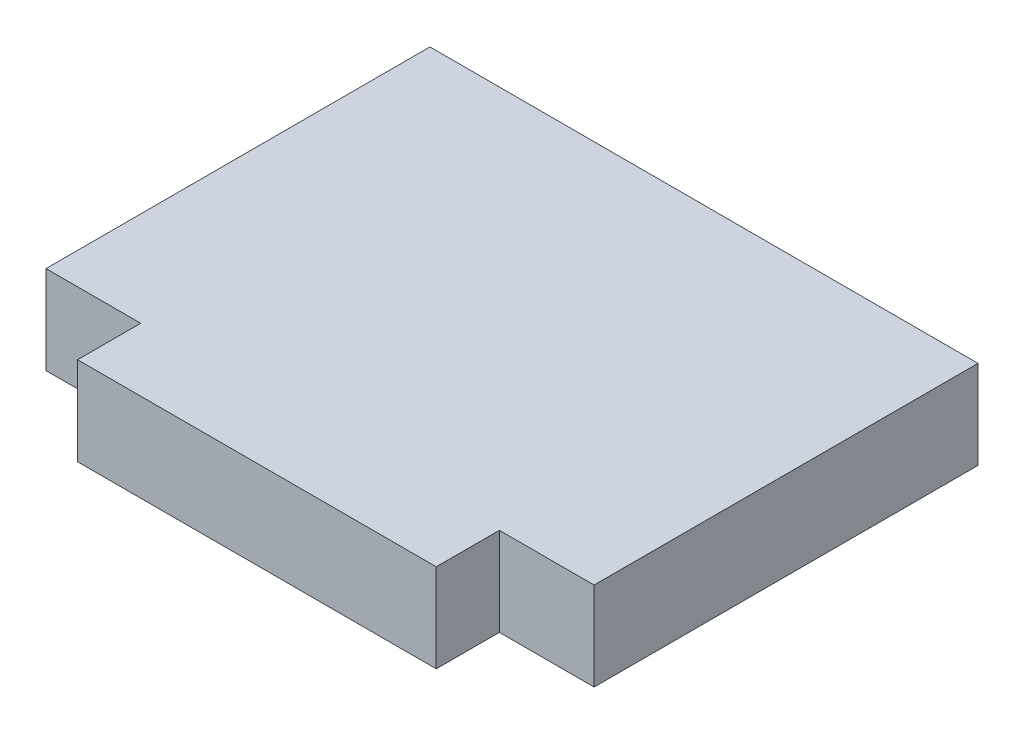
ISO-10303-21;
HEADER;
FILE_DESCRIPTION(('STEP AP214'),'2;1');
FILE_NAME('part.step','',(''),(''),'','','');
FILE_SCHEMA(('AUTOMOTIVE_DESIGN { 1 0 10303 214 1 1 1 1 }'));
ENDSEC;
DATA;
#1=APPLICATION_CONTEXT('core data for automotive mechanical design processes');
#2=APPLICATION_PROTOCOL_DEFINITION('international standard','automotive_design',2000,#1);
#3=PRODUCT_CONTEXT('',#1,'mechanical');
#4=PRODUCT('Part','Part','',(#3));
#5=PRODUCT_RELATED_PRODUCT_CATEGORY('part','',(#4));
#6=PRODUCT_DEFINITION_FORMATION('','',#4);
#7=PRODUCT_DEFINITION_CONTEXT('part definition',#1,'design');
#8=PRODUCT_DEFINITION('design','',#6,#7);
#9=PRODUCT_DEFINITION_SHAPE('','',#8);
#10=(LENGTH_UNIT() NAMED_UNIT(*) SI_UNIT(.MILLI.,.METRE.));
#11=(NAMED_UNIT(*) PLANE_ANGLE_UNIT() SI_UNIT($,.RADIAN.));
#12=(NAMED_UNIT(*) SI_UNIT($,.STERADIAN.) SOLID_ANGLE_UNIT());
#13=UNCERTAINTY_MEASURE_WITH_UNIT(LENGTH_MEASURE(1.E-05),#10,'distance_accuracy_value','');
#14=(GEOMETRIC_REPRESENTATION_CONTEXT(3) GLOBAL_UNCERTAINTY_ASSIGNED_CONTEXT((#13)) GLOBAL_UNIT_ASSIGNED_CONTEXT((#10,
#11,#12)) REPRESENTATION_CONTEXT('',''));
#15=CARTESIAN_POINT('',(0.,0.,0.));
#16=DIRECTION('',(0.,0.,1.));
#17=DIRECTION('',(1.,0.,0.));
#18=AXIS2_PLACEMENT_3D('',#15,#16,#17);
#19=CARTESIAN_POINT('',(55.118,17.78,-25.2860927835052));
#20=DIRECTION('',(-1.,0.,0.));
#21=DIRECTION('',(0.,0.,1.));
#22=AXIS2_PLACEMENT_3D('',#19,#20,#21);
#23=PLANE('',#22);
#24=DIRECTION('',(0.,0.,-1.));
#25=VECTOR('',#24,1.);
#26=CARTESIAN_POINT('',(55.118,17.78,-25.2860927835052));
#27=LINE('',#26,#25);
#28=CARTESIAN_POINT('',(55.118,17.78,51.9299072164948));
#29=VERTEX_POINT('',#28);
#30=CARTESIAN_POINT('',(55.118,17.78,-25.2860927835052));
#31=VERTEX_POINT('',#30);
#32=EDGE_CURVE('E127',#29,#31,#27,.T.);
#33=ORIENTED_EDGE('',*,*,#32,.F.);
#34=DIRECTION('',(0.,1.,0.));
#35=VECTOR('',#34,1.);
#36=CARTESIAN_POINT('',(55.118,0.,51.9299072164948));
#37=LINE('',#36,#35);
#38=CARTESIAN_POINT('',(55.118,0.,51.9299072164948));
#39=VERTEX_POINT('',#38);
#40=EDGE_CURVE('E174',#39,#29,#37,.T.);
#41=ORIENTED_EDGE('',*,*,#40,.F.);
#42=DIRECTION('',(0.,0.,-1.));
#43=VECTOR('',#42,1.);
#44=CARTESIAN_POINT('',(55.118,0.,-25.2860927835052));
#45=LINE('',#44,#43);
#46=CARTESIAN_POINT('',(55.118,0.,-25.2860927835052));
#47=VERTEX_POINT('',#46);
#48=EDGE_CURVE('E154',#39,#47,#45,.T.);
#49=ORIENTED_EDGE('',*,*,#48,.T.);
#50=DIRECTION('',(0.,-1.,0.));
#51=VECTOR('',#50,1.);
#52=CARTESIAN_POINT('',(55.118,17.78,-25.2860927835052));
#53=LINE('',#52,#51);
#54=EDGE_CURVE('E11',#31,#47,#53,.T.);
#55=ORIENTED_EDGE('',*,*,#54,.F.);
#56=EDGE_LOOP('',(#33,#41,#49,#55));
#57=FACE_BOUND('',#56,.T.);
#58=ADVANCED_FACE('F38',(#57),#23,.F.);
#59=CARTESIAN_POINT('',(-55.118,17.78,-25.2860927835052));
#60=DIRECTION('',(0.,0.,1.));
#61=DIRECTION('',(1.,0.,0.));
#62=AXIS2_PLACEMENT_3D('',#59,#60,#61);
#63=PLANE('',#62);
#64=DIRECTION('',(-1.,0.,0.));
#65=VECTOR('',#64,1.);
#66=CARTESIAN_POINT('',(-55.118,0.,-25.2860927835052));
#67=LINE('',#66,#65);
#68=CARTESIAN_POINT('',(-55.118,0.,-25.2860927835052));
#69=VERTEX_POINT('',#68);
#70=EDGE_CURVE('E135',#47,#69,#67,.T.);
#71=ORIENTED_EDGE('',*,*,#70,.T.);
#72=DIRECTION('',(0.,-1.,0.));
#73=VECTOR('',#72,1.);
#74=CARTESIAN_POINT('',(-55.118,17.78,-25.2860927835052));
#75=LINE('',#74,#73);
#76=CARTESIAN_POINT('',(-55.118,17.78,-25.2860927835052));
#77=VERTEX_POINT('',#76);
#78=EDGE_CURVE('E46',#77,#69,#75,.T.);
#79=ORIENTED_EDGE('',*,*,#78,.F.);
#80=DIRECTION('',(-1.,0.,0.));
#81=VECTOR('',#80,1.);
#82=CARTESIAN_POINT('',(-55.118,17.78,-25.2860927835052));
#83=LINE('',#82,#81);
#84=EDGE_CURVE('E132',#31,#77,#83,.T.);
#85=ORIENTED_EDGE('',*,*,#84,.F.);
#86=ORIENTED_EDGE('',*,*,#54,.T.);
#87=EDGE_LOOP('',(#71,#79,#85,#86));
#88=FACE_BOUND('',#87,.T.);
#89=ADVANCED_FACE('F160',(#88),#63,.F.);
#90=CARTESIAN_POINT('',(-55.118,17.78,-25.2860927835052));
#91=DIRECTION('',(1.,0.,0.));
#92=DIRECTION('',(0.,0.,-1.));
#93=AXIS2_PLACEMENT_3D('',#90,#91,#92);
#94=PLANE('',#93);
#95=DIRECTION('',(0.,0.,1.));
#96=VECTOR('',#95,1.);
#97=CARTESIAN_POINT('',(-55.118,0.,-25.2860927835052));
#98=LINE('',#97,#96);
#99=CARTESIAN_POINT('',(-55.118,0.,51.9299072164948));
#100=VERTEX_POINT('',#99);
#101=EDGE_CURVE('E128',#69,#100,#98,.T.);
#102=ORIENTED_EDGE('',*,*,#101,.T.);
#103=DIRECTION('',(0.,1.,0.));
#104=VECTOR('',#103,1.);
#105=CARTESIAN_POINT('',(-55.118,0.,51.9299072164948));
#106=LINE('',#105,#104);
#107=CARTESIAN_POINT('',(-55.118,17.78,51.9299072164948));
#108=VERTEX_POINT('',#107);
#109=EDGE_CURVE('E156',#100,#108,#106,.T.);
#110=ORIENTED_EDGE('',*,*,#109,.T.);
#111=DIRECTION('',(0.,0.,1.));
#112=VECTOR('',#111,1.);
#113=CARTESIAN_POINT('',(-55.118,17.78,-25.2860927835052));
#114=LINE('',#113,#112);
#115=EDGE_CURVE('E145',#77,#108,#114,.T.);
#116=ORIENTED_EDGE('',*,*,#115,.F.);
#117=ORIENTED_EDGE('',*,*,#78,.T.);
#118=EDGE_LOOP('',(#102,#110,#116,#117));
#119=FACE_BOUND('',#118,.T.);
#120=ADVANCED_FACE('F165',(#119),#94,.F.);
#121=CARTESIAN_POINT('',(-55.118,17.78,64.6299072164948));
#122=DIRECTION('',(0.,0.,-1.));
#123=DIRECTION('',(-1.,0.,0.));
#124=AXIS2_PLACEMENT_3D('',#121,#122,#123);
#125=PLANE('',#124);
#126=DIRECTION('',(1.,0.,0.));
#127=VECTOR('',#126,1.);
#128=CARTESIAN_POINT('',(-55.118,17.78,64.6299072164948));
#129=LINE('',#128,#127);
#130=CARTESIAN_POINT('',(-36.068,17.78,64.6299072164948));
#131=VERTEX_POINT('',#130);
#132=CARTESIAN_POINT('',(36.068,17.78,64.6299072164948));
#133=VERTEX_POINT('',#132);
#134=EDGE_CURVE('E121',#131,#133,#129,.T.);
#135=ORIENTED_EDGE('',*,*,#134,.F.);
#136=DIRECTION('',(0.,1.,0.));
#137=VECTOR('',#136,1.);
#138=CARTESIAN_POINT('',(-36.068,0.,64.6299072164948));
#139=LINE('',#138,#137);
#140=CARTESIAN_POINT('',(-36.068,0.,64.6299072164948));
#141=VERTEX_POINT('',#140);
#142=EDGE_CURVE('E106',#141,#131,#139,.T.);
#143=ORIENTED_EDGE('',*,*,#142,.F.);
#144=DIRECTION('',(1.,0.,0.));
#145=VECTOR('',#144,1.);
#146=CARTESIAN_POINT('',(-55.118,0.,64.6299072164948));
#147=LINE('',#146,#145);
#148=CARTESIAN_POINT('',(36.068,0.,64.6299072164948));
#149=VERTEX_POINT('',#148);
#150=EDGE_CURVE('E119',#141,#149,#147,.T.);
#151=ORIENTED_EDGE('',*,*,#150,.T.);
#152=DIRECTION('',(0.,1.,0.));
#153=VECTOR('',#152,1.);
#154=CARTESIAN_POINT('',(36.068,0.,64.6299072164948));
#155=LINE('',#154,#153);
#156=EDGE_CURVE('E180',#149,#133,#155,.T.);
#157=ORIENTED_EDGE('',*,*,#156,.T.);
#158=EDGE_LOOP('',(#135,#143,#151,#157));
#159=FACE_BOUND('',#158,.T.);
#160=ADVANCED_FACE('F117',(#159),#125,.F.);
#161=CARTESIAN_POINT('',(0.,17.78,0.));
#162=DIRECTION('',(0.,1.,0.));
#163=DIRECTION('',(0.,0.,1.));
#164=AXIS2_PLACEMENT_3D('',#161,#162,#163);
#165=PLANE('',#164);
#166=DIRECTION('',(-1.,0.,0.));
#167=VECTOR('',#166,1.);
#168=CARTESIAN_POINT('',(-55.118,17.78,51.9299072164948));
#169=LINE('',#168,#167);
#170=CARTESIAN_POINT('',(-36.068,17.78,51.9299072164948));
#171=VERTEX_POINT('',#170);
#172=EDGE_CURVE('E112',#171,#108,#169,.T.);
#173=ORIENTED_EDGE('',*,*,#172,.F.);
#174=DIRECTION('',(0.,0.,-1.));
#175=VECTOR('',#174,1.);
#176=CARTESIAN_POINT('',(-36.068,17.78,64.6299072164948));
#177=LINE('',#176,#175);
#178=EDGE_CURVE('E183',#131,#171,#177,.T.);
#179=ORIENTED_EDGE('',*,*,#178,.F.);
#180=ORIENTED_EDGE('',*,*,#134,.T.);
#181=DIRECTION('',(0.,0.,1.));
#182=VECTOR('',#181,1.);
#183=CARTESIAN_POINT('',(36.068,17.78,64.6299072164948));
#184=LINE('',#183,#182);
#185=CARTESIAN_POINT('',(36.068,17.78,51.9299072164948));
#186=VERTEX_POINT('',#185);
#187=EDGE_CURVE('E184',#186,#133,#184,.T.);
#188=ORIENTED_EDGE('',*,*,#187,.F.);
#189=DIRECTION('',(-1.,0.,0.));
#190=VECTOR('',#189,1.);
#191=CARTESIAN_POINT('',(55.118,17.78,51.9299072164948));
#192=LINE('',#191,#190);
#193=EDGE_CURVE('E188',#29,#186,#192,.T.);
#194=ORIENTED_EDGE('',*,*,#193,.F.);
#195=ORIENTED_EDGE('',*,*,#32,.T.);
#196=ORIENTED_EDGE('',*,*,#84,.T.);
#197=ORIENTED_EDGE('',*,*,#115,.T.);
#198=EDGE_LOOP('',(#173,#179,#180,#188,#194,#195,#196,#197));
#199=FACE_BOUND('',#198,.T.);
#200=ADVANCED_FACE('F169',(#199),#165,.T.);
#201=CARTESIAN_POINT('',(0.,0.,0.));
#202=DIRECTION('',(0.,1.,0.));
#203=DIRECTION('',(0.,0.,1.));
#204=AXIS2_PLACEMENT_3D('',#201,#202,#203);
#205=PLANE('',#204);
#206=DIRECTION('',(0.,0.,-1.));
#207=VECTOR('',#206,1.);
#208=CARTESIAN_POINT('',(-36.068,0.,64.6299072164948));
#209=LINE('',#208,#207);
#210=CARTESIAN_POINT('',(-36.068,0.,51.9299072164948));
#211=VERTEX_POINT('',#210);
#212=EDGE_CURVE('E102',#141,#211,#209,.T.);
#213=ORIENTED_EDGE('',*,*,#212,.T.);
#214=DIRECTION('',(-1.,0.,0.));
#215=VECTOR('',#214,1.);
#216=CARTESIAN_POINT('',(-55.118,0.,51.9299072164948));
#217=LINE('',#216,#215);
#218=EDGE_CURVE('E53',#211,#100,#217,.T.);
#219=ORIENTED_EDGE('',*,*,#218,.T.);
#220=ORIENTED_EDGE('',*,*,#101,.F.);
#221=ORIENTED_EDGE('',*,*,#70,.F.);
#222=ORIENTED_EDGE('',*,*,#48,.F.);
#223=DIRECTION('',(-1.,0.,0.));
#224=VECTOR('',#223,1.);
#225=CARTESIAN_POINT('',(55.118,0.,51.9299072164948));
#226=LINE('',#225,#224);
#227=CARTESIAN_POINT('',(36.068,0.,51.9299072164948));
#228=VERTEX_POINT('',#227);
#229=EDGE_CURVE('E187',#39,#228,#226,.T.);
#230=ORIENTED_EDGE('',*,*,#229,.T.);
#231=DIRECTION('',(0.,0.,1.));
#232=VECTOR('',#231,1.);
#233=CARTESIAN_POINT('',(36.068,0.,64.6299072164948));
#234=LINE('',#233,#232);
#235=EDGE_CURVE('E61',#228,#149,#234,.T.);
#236=ORIENTED_EDGE('',*,*,#235,.T.);
#237=ORIENTED_EDGE('',*,*,#150,.F.);
#238=EDGE_LOOP('',(#213,#219,#220,#221,#222,#230,#236,#237));
#239=FACE_BOUND('',#238,.T.);
#240=ADVANCED_FACE('F124',(#239),#205,.F.);
#241=CARTESIAN_POINT('',(36.068,0.,64.6299072164948));
#242=DIRECTION('',(-1.,0.,0.));
#243=DIRECTION('',(0.,0.,1.));
#244=AXIS2_PLACEMENT_3D('',#241,#242,#243);
#245=PLANE('',#244);
#246=ORIENTED_EDGE('',*,*,#187,.T.);
#247=ORIENTED_EDGE('',*,*,#156,.F.);
#248=ORIENTED_EDGE('',*,*,#235,.F.);
#249=DIRECTION('',(0.,1.,0.));
#250=VECTOR('',#249,1.);
#251=CARTESIAN_POINT('',(36.068,0.,51.9299072164948));
#252=LINE('',#251,#250);
#253=EDGE_CURVE('E177',#228,#186,#252,.T.);
#254=ORIENTED_EDGE('',*,*,#253,.T.);
#255=EDGE_LOOP('',(#246,#247,#248,#254));
#256=FACE_BOUND('',#255,.T.);
#257=ADVANCED_FACE('F212',(#256),#245,.F.);
#258=CARTESIAN_POINT('',(55.118,0.,51.9299072164948));
#259=DIRECTION('',(0.,0.,-1.));
#260=DIRECTION('',(-1.,0.,0.));
#261=AXIS2_PLACEMENT_3D('',#258,#259,#260);
#262=PLANE('',#261);
#263=ORIENTED_EDGE('',*,*,#193,.T.);
#264=ORIENTED_EDGE('',*,*,#253,.F.);
#265=ORIENTED_EDGE('',*,*,#229,.F.);
#266=ORIENTED_EDGE('',*,*,#40,.T.);
#267=EDGE_LOOP('',(#263,#264,#265,#266));
#268=FACE_BOUND('',#267,.T.);
#269=ADVANCED_FACE('F205',(#268),#262,.F.);
#270=CARTESIAN_POINT('',(-55.118,0.,51.9299072164948));
#271=DIRECTION('',(0.,0.,-1.));
#272=DIRECTION('',(-1.,0.,0.));
#273=AXIS2_PLACEMENT_3D('',#270,#271,#272);
#274=PLANE('',#273);
#275=ORIENTED_EDGE('',*,*,#172,.T.);
#276=ORIENTED_EDGE('',*,*,#109,.F.);
#277=ORIENTED_EDGE('',*,*,#218,.F.);
#278=DIRECTION('',(0.,1.,0.));
#279=VECTOR('',#278,1.);
#280=CARTESIAN_POINT('',(-36.068,0.,51.9299072164948));
#281=LINE('',#280,#279);
#282=EDGE_CURVE('E108',#211,#171,#281,.T.);
#283=ORIENTED_EDGE('',*,*,#282,.T.);
#284=EDGE_LOOP('',(#275,#276,#277,#283));
#285=FACE_BOUND('',#284,.T.);
#286=ADVANCED_FACE('F203',(#285),#274,.F.);
#287=CARTESIAN_POINT('',(-36.068,0.,64.6299072164948));
#288=DIRECTION('',(1.,0.,0.));
#289=DIRECTION('',(0.,0.,-1.));
#290=AXIS2_PLACEMENT_3D('',#287,#288,#289);
#291=PLANE('',#290);
#292=ORIENTED_EDGE('',*,*,#178,.T.);
#293=ORIENTED_EDGE('',*,*,#282,.F.);
#294=ORIENTED_EDGE('',*,*,#212,.F.);
#295=ORIENTED_EDGE('',*,*,#142,.T.);
#296=EDGE_LOOP('',(#292,#293,#294,#295));
#297=FACE_BOUND('',#296,.T.);
#298=ADVANCED_FACE('F105',(#297),#291,.F.);
#299=CLOSED_SHELL('',(#58,#89,#120,#160,#200,#240,#257,#269,#286,#298));
#300=MANIFOLD_SOLID_BREP('B2',#299);
#301=ADVANCED_BREP_SHAPE_REPRESENTATION('',(#18,#300),#14);
#302=SHAPE_DEFINITION_REPRESENTATION(#9,#301);
ENDSEC;
END-ISO-10303-21;
